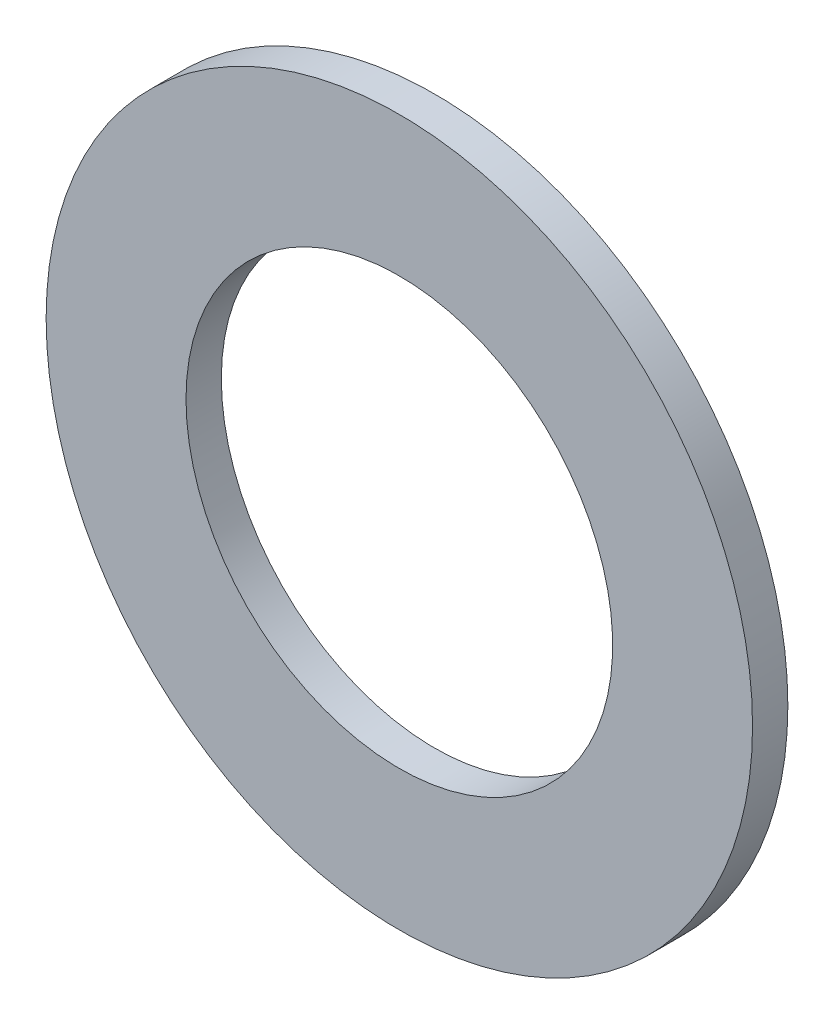
ISO-10303-21;
HEADER;
FILE_DESCRIPTION(('STEP AP214'),'2;1');
FILE_NAME('part.step','',(''),(''),'','','');
FILE_SCHEMA(('AUTOMOTIVE_DESIGN { 1 0 10303 214 1 1 1 1 }'));
ENDSEC;
DATA;
#1=APPLICATION_CONTEXT('core data for automotive mechanical design processes');
#2=APPLICATION_PROTOCOL_DEFINITION('international standard','automotive_design',2000,#1);
#3=PRODUCT_CONTEXT('',#1,'mechanical');
#4=PRODUCT('Part','Part','',(#3));
#5=PRODUCT_RELATED_PRODUCT_CATEGORY('part','',(#4));
#6=PRODUCT_DEFINITION_FORMATION('','',#4);
#7=PRODUCT_DEFINITION_CONTEXT('part definition',#1,'design');
#8=PRODUCT_DEFINITION('design','',#6,#7);
#9=PRODUCT_DEFINITION_SHAPE('','',#8);
#10=(LENGTH_UNIT() NAMED_UNIT(*) SI_UNIT(.MILLI.,.METRE.));
#11=(NAMED_UNIT(*) PLANE_ANGLE_UNIT() SI_UNIT($,.RADIAN.));
#12=(NAMED_UNIT(*) SI_UNIT($,.STERADIAN.) SOLID_ANGLE_UNIT());
#13=UNCERTAINTY_MEASURE_WITH_UNIT(LENGTH_MEASURE(1.E-05),#10,'distance_accuracy_value','');
#14=(GEOMETRIC_REPRESENTATION_CONTEXT(3) GLOBAL_UNCERTAINTY_ASSIGNED_CONTEXT((#13)) GLOBAL_UNIT_ASSIGNED_CONTEXT((#10,
#11,#12)) REPRESENTATION_CONTEXT('',''));
#15=CARTESIAN_POINT('',(0.,0.,0.));
#16=DIRECTION('',(0.,0.,1.));
#17=DIRECTION('',(1.,0.,0.));
#18=AXIS2_PLACEMENT_3D('',#15,#16,#17);
#19=CARTESIAN_POINT('',(0.,0.,-0.79375));
#20=DIRECTION('',(0.,0.,1.));
#21=DIRECTION('',(1.,0.,0.));
#22=AXIS2_PLACEMENT_3D('',#19,#20,#21);
#23=PLANE('',#22);
#24=CARTESIAN_POINT('',(0.,0.,-0.79375));
#25=DIRECTION('',(0.,0.,-1.));
#26=DIRECTION('',(-1.,0.,0.));
#27=AXIS2_PLACEMENT_3D('',#24,#25,#26);
#28=CIRCLE('',#27,9.5885);
#29=CARTESIAN_POINT('',(-9.5885,0.,-0.79375));
#30=VERTEX_POINT('',#29);
#31=EDGE_CURVE('E26',#30,#30,#28,.F.);
#32=ORIENTED_EDGE('',*,*,#31,.T.);
#33=EDGE_LOOP('',(#32));
#34=FACE_BOUND('',#33,.T.);
#35=CARTESIAN_POINT('',(0.,0.,-0.79375));
#36=DIRECTION('',(0.,0.,-1.));
#37=DIRECTION('',(-1.,0.,0.));
#38=AXIS2_PLACEMENT_3D('',#35,#36,#37);
#39=CIRCLE('',#38,15.875);
#40=CARTESIAN_POINT('',(-15.875,0.,-0.79375));
#41=VERTEX_POINT('',#40);
#42=EDGE_CURVE('E17',#41,#41,#39,.F.);
#43=ORIENTED_EDGE('',*,*,#42,.F.);
#44=EDGE_LOOP('',(#43));
#45=FACE_BOUND('',#44,.T.);
#46=ADVANCED_FACE('F14',(#34,#45),#23,.F.);
#47=CARTESIAN_POINT('',(0.,0.,0.79375));
#48=DIRECTION('',(0.,0.,-1.));
#49=DIRECTION('',(-1.,0.,0.));
#50=AXIS2_PLACEMENT_3D('',#47,#48,#49);
#51=CYLINDRICAL_SURFACE('',#50,15.875);
#52=ORIENTED_EDGE('',*,*,#42,.T.);
#53=EDGE_LOOP('',(#52));
#54=FACE_BOUND('',#53,.T.);
#55=CARTESIAN_POINT('',(0.,0.,0.79375));
#56=DIRECTION('',(0.,0.,-1.));
#57=DIRECTION('',(-1.,0.,0.));
#58=AXIS2_PLACEMENT_3D('',#55,#56,#57);
#59=CIRCLE('',#58,15.875);
#60=CARTESIAN_POINT('',(-15.875,0.,0.79375));
#61=VERTEX_POINT('',#60);
#62=EDGE_CURVE('E21',#61,#61,#59,.F.);
#63=ORIENTED_EDGE('',*,*,#62,.F.);
#64=EDGE_LOOP('',(#63));
#65=FACE_BOUND('',#64,.T.);
#66=ADVANCED_FACE('F34',(#54,#65),#51,.T.);
#67=CARTESIAN_POINT('',(0.,0.,0.79375));
#68=DIRECTION('',(0.,0.,-1.));
#69=DIRECTION('',(-1.,0.,0.));
#70=AXIS2_PLACEMENT_3D('',#67,#68,#69);
#71=CYLINDRICAL_SURFACE('',#70,9.5885);
#72=CARTESIAN_POINT('',(0.,0.,0.79375));
#73=DIRECTION('',(0.,0.,-1.));
#74=DIRECTION('',(-1.,0.,0.));
#75=AXIS2_PLACEMENT_3D('',#72,#73,#74);
#76=CIRCLE('',#75,9.5885);
#77=CARTESIAN_POINT('',(-9.5885,0.,0.79375));
#78=VERTEX_POINT('',#77);
#79=EDGE_CURVE('E9',#78,#78,#76,.T.);
#80=ORIENTED_EDGE('',*,*,#79,.F.);
#81=EDGE_LOOP('',(#80));
#82=FACE_BOUND('',#81,.T.);
#83=ORIENTED_EDGE('',*,*,#31,.F.);
#84=EDGE_LOOP('',(#83));
#85=FACE_BOUND('',#84,.T.);
#86=ADVANCED_FACE('F42',(#82,#85),#71,.F.);
#87=CARTESIAN_POINT('',(0.,0.,0.79375));
#88=DIRECTION('',(0.,0.,1.));
#89=DIRECTION('',(1.,0.,0.));
#90=AXIS2_PLACEMENT_3D('',#87,#88,#89);
#91=PLANE('',#90);
#92=ORIENTED_EDGE('',*,*,#79,.T.);
#93=EDGE_LOOP('',(#92));
#94=FACE_BOUND('',#93,.T.);
#95=ORIENTED_EDGE('',*,*,#62,.T.);
#96=EDGE_LOOP('',(#95));
#97=FACE_BOUND('',#96,.T.);
#98=ADVANCED_FACE('F43',(#94,#97),#91,.T.);
#99=CLOSED_SHELL('',(#46,#66,#86,#98));
#100=MANIFOLD_SOLID_BREP('B1',#99);
#101=ADVANCED_BREP_SHAPE_REPRESENTATION('',(#18,#100),#14);
#102=SHAPE_DEFINITION_REPRESENTATION(#9,#101);
ENDSEC;
END-ISO-10303-21;
